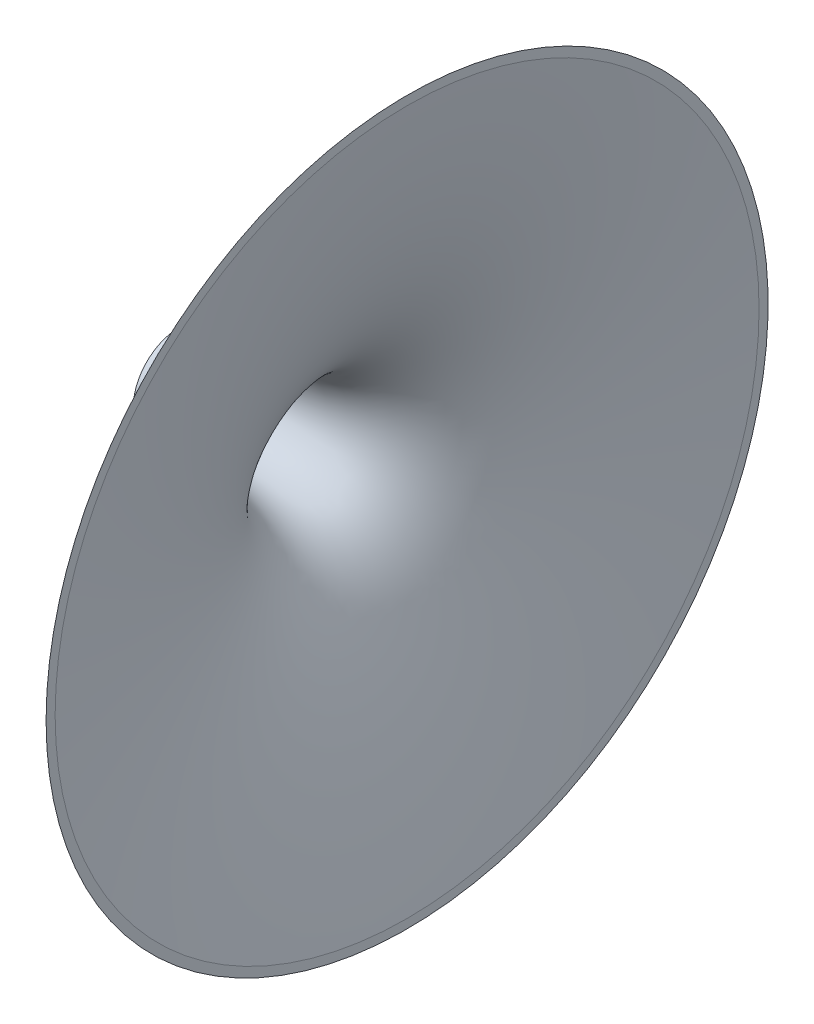
ISO-10303-21;
HEADER;
FILE_DESCRIPTION(('STEP AP214'),'2;1');
FILE_NAME('part.step','',(''),(''),'','','');
FILE_SCHEMA(('AUTOMOTIVE_DESIGN { 1 0 10303 214 1 1 1 1 }'));
ENDSEC;
DATA;
#1=APPLICATION_CONTEXT('core data for automotive mechanical design processes');
#2=APPLICATION_PROTOCOL_DEFINITION('international standard','automotive_design',2000,#1);
#3=PRODUCT_CONTEXT('',#1,'mechanical');
#4=PRODUCT('Part','Part','',(#3));
#5=PRODUCT_RELATED_PRODUCT_CATEGORY('part','',(#4));
#6=PRODUCT_DEFINITION_FORMATION('','',#4);
#7=PRODUCT_DEFINITION_CONTEXT('part definition',#1,'design');
#8=PRODUCT_DEFINITION('design','',#6,#7);
#9=PRODUCT_DEFINITION_SHAPE('','',#8);
#10=(LENGTH_UNIT() NAMED_UNIT(*) SI_UNIT(.MILLI.,.METRE.));
#11=(NAMED_UNIT(*) PLANE_ANGLE_UNIT() SI_UNIT($,.RADIAN.));
#12=(NAMED_UNIT(*) SI_UNIT($,.STERADIAN.) SOLID_ANGLE_UNIT());
#13=UNCERTAINTY_MEASURE_WITH_UNIT(LENGTH_MEASURE(1.E-05),#10,'distance_accuracy_value','');
#14=(GEOMETRIC_REPRESENTATION_CONTEXT(3) GLOBAL_UNCERTAINTY_ASSIGNED_CONTEXT((#13)) GLOBAL_UNIT_ASSIGNED_CONTEXT((#10,
#11,#12)) REPRESENTATION_CONTEXT('',''));
#15=CARTESIAN_POINT('',(0.,0.,0.));
#16=DIRECTION('',(0.,0.,1.));
#17=DIRECTION('',(1.,0.,0.));
#18=AXIS2_PLACEMENT_3D('',#15,#16,#17);
#19=CARTESIAN_POINT('',(62.8318530769264,99.7041526839094,0.));
#20=CARTESIAN_POINT('',(62.7669834738986,99.1988027934234,0.));
#21=CARTESIAN_POINT('',(62.6336701977316,98.1705809868923,0.));
#22=CARTESIAN_POINT('',(62.3544242130385,96.0424346727773,0.));
#23=CARTESIAN_POINT('',(62.0751013967572,93.9964608352909,0.));
#24=CARTESIAN_POINT('',(61.7313801557469,91.5195678656756,0.));
#25=CARTESIAN_POINT('',(61.410020240338,89.2917721485079,0.));
#26=CARTESIAN_POINT('',(61.0602038453941,86.9215437885587,0.));
#27=CARTESIAN_POINT('',(60.7101223802966,84.6334820961523,0.));
#28=CARTESIAN_POINT('',(60.2520981621779,81.725934740197,0.));
#29=CARTESIAN_POINT('',(59.681909059244,78.2673849163959,0.));
#30=CARTESIAN_POINT('',(58.9762772849989,74.2225813166756,0.));
#31=CARTESIAN_POINT('',(58.1107910302528,69.6207993004724,0.));
#32=CARTESIAN_POINT('',(57.1751523698545,65.0272397356999,0.));
#33=CARTESIAN_POINT('',(56.1586009502352,60.453904580494,0.));
#34=CARTESIAN_POINT('',(54.7684387417132,54.7628288542091,0.));
#35=CARTESIAN_POINT('',(53.1091163003201,48.8408966843822,0.));
#36=CARTESIAN_POINT('',(51.1729710091545,42.99939704834,0.));
#37=CARTESIAN_POINT('',(48.8444677468666,37.3182379190862,0.));
#38=CARTESIAN_POINT('',(46.8164012205755,33.2141247610398,0.));
#39=CARTESIAN_POINT('',(44.835264421067,29.8597976455631,0.));
#40=CARTESIAN_POINT('',(42.8548428486411,27.0548176259,0.));
#41=CARTESIAN_POINT('',(41.0428539358283,24.879922816341,0.));
#42=CARTESIAN_POINT('',(39.2170568829794,23.0223523189198,0.));
#43=CARTESIAN_POINT('',(37.4207145475656,21.4636501936447,0.));
#44=CARTESIAN_POINT('',(35.6358214509231,20.1378843785432,0.));
#45=CARTESIAN_POINT('',(33.7416925402109,18.9445961600642,0.));
#46=CARTESIAN_POINT('',(31.5993743316205,17.8108952161234,0.));
#47=CARTESIAN_POINT('',(29.2039422940924,16.7757108031768,0.));
#48=CARTESIAN_POINT('',(26.7821862036701,15.9449391265195,0.));
#49=CARTESIAN_POINT('',(24.3759366618418,15.2858495110727,0.));
#50=CARTESIAN_POINT('',(22.1229198972689,14.7809900065511,0.));
#51=CARTESIAN_POINT('',(20.034775641693,14.3916870651941,0.));
#52=CARTESIAN_POINT('',(17.4555340992771,13.9941368122836,0.));
#53=CARTESIAN_POINT('',(14.8721495276552,13.6857871928924,0.));
#54=CARTESIAN_POINT('',(12.3439656627703,13.4482991137871,0.));
#55=CARTESIAN_POINT('',(9.8065608570677,13.2591101041778,0.));
#56=CARTESIAN_POINT('',(7.71304149017419,13.1290273457748,0.));
#57=CARTESIAN_POINT('',(5.81949010738295,13.0323142166122,0.));
#58=CARTESIAN_POINT('',(4.17379671333692,12.960382125344,0.));
#59=CARTESIAN_POINT('',(2.75396102083383,12.9064290200789,0.));
#60=CARTESIAN_POINT('',(1.72293716722093,12.8702497615375,0.));
#61=CARTESIAN_POINT('',(0.734433958976591,12.8397158124545,0.));
#62=CARTESIAN_POINT('',(0.241417510162973,12.8251747616701,0.));
#63=CARTESIAN_POINT('',(1.66419893002975E-08,12.818309886657,0.));
#64=B_SPLINE_CURVE_WITH_KNOTS('',4,(#19,#20,#21,#22,#23,#24,#25,#26,#27,#28,#29,#30,#31,#32,#33,
#34,#35,#36,#37,#38,#39,#40,#41,#42,#43,#44,#45,#46,#47,#48,#49,#50,#51,#52,#53,#54,#55,#56,#57,
#58,#59,#60,#61,#62,#63),.UNSPECIFIED.,.F.,.F.,(5,1,1,1,1,1,1,1,1,1,1,1,1,1,1,1,1,1,1,1,1,1,1,1,
1,1,1,1,1,1,1,1,1,1,1,1,1,1,1,1,1,5),(0.0444810040283786,0.0610632796456602,0.0776455553349109,
0.0942278310241617,0.110810106713413,0.1273924442207,0.143974781727987,0.160557119235274,
0.177139456742561,0.210303468521247,0.243467480299934,0.276631409159663,0.309795338019393,
0.342959705599658,0.376124073179923,0.44245188977636,0.483876253842112,0.517040291529561,
0.549829175403092,0.571938566395502,0.594047848498678,0.614154571529794,0.629876067830825,
0.645596849685218,0.661317399353499,0.677038490645515,0.693192797636185,0.714153952455607,
0.735115088037345,0.749451703558317,0.763788319079289,0.779509218902208,0.795230118725127,
0.823340618425267,0.837395868275337,0.851451118125408,0.86717201284851,0.882892907571612,
0.890753354933163,0.898613802294714,0.906474249656265,0.914334697156908),.UNSPECIFIED.);
#65=CARTESIAN_POINT('',(0.,0.,0.));
#66=DIRECTION('',(-1.,0.,0.));
#67=AXIS1_PLACEMENT('',#65,#66);
#68=SURFACE_OF_REVOLUTION('',#64,#67);
#69=CARTESIAN_POINT('',(0.,0.,0.));
#70=DIRECTION('',(-1.,0.,0.));
#71=DIRECTION('',(0.,0.,1.));
#72=AXIS2_PLACEMENT_3D('',#69,#70,#71);
#73=CIRCLE('',#72,12.8183098861838);
#74=CARTESIAN_POINT('',(0.,0.,12.8183098861838));
#75=VERTEX_POINT('',#74);
#76=EDGE_CURVE('E48',#75,#75,#73,.T.);
#77=ORIENTED_EDGE('',*,*,#76,.F.);
#78=EDGE_LOOP('',(#77));
#79=FACE_BOUND('',#78,.T.);
#80=CARTESIAN_POINT('',(62.8318530717959,0.,0.));
#81=DIRECTION('',(-1.,0.,0.));
#82=DIRECTION('',(0.,0.,1.));
#83=AXIS2_PLACEMENT_3D('',#80,#81,#82);
#84=CIRCLE('',#83,99.7041526751117);
#85=CARTESIAN_POINT('',(62.8318530717959,0.,99.7041526751117));
#86=VERTEX_POINT('',#85);
#87=EDGE_CURVE('E10',#86,#86,#84,.T.);
#88=ORIENTED_EDGE('',*,*,#87,.T.);
#89=EDGE_LOOP('',(#88));
#90=FACE_BOUND('',#89,.T.);
#91=ADVANCED_FACE('F33',(#79,#90),#68,.T.);
#92=CARTESIAN_POINT('',(62.8318530719139,99.7041526751117,0.));
#93=DIRECTION('',(-1.,0.,0.));
#94=DIRECTION('',(0.,0.,1.));
#95=AXIS2_PLACEMENT_3D('',#92,#93,#94);
#96=PLANE('',#95);
#97=ORIENTED_EDGE('',*,*,#87,.F.);
#98=EDGE_LOOP('',(#97));
#99=FACE_BOUND('',#98,.T.);
#100=CARTESIAN_POINT('',(62.8318530720318,0.,0.));
#101=DIRECTION('',(-1.,0.,0.));
#102=DIRECTION('',(0.,0.,1.));
#103=AXIS2_PLACEMENT_3D('',#100,#101,#102);
#104=CIRCLE('',#103,97.2041526765341);
#105=CARTESIAN_POINT('',(62.8318530720318,0.,97.2041526765341));
#106=VERTEX_POINT('',#105);
#107=EDGE_CURVE('E40',#106,#106,#104,.T.);
#108=ORIENTED_EDGE('',*,*,#107,.T.);
#109=EDGE_LOOP('',(#108));
#110=FACE_BOUND('',#109,.T.);
#111=ADVANCED_FACE('F67',(#99,#110),#96,.F.);
#112=CARTESIAN_POINT('',(1.7518128061448E-09,10.3183098853196,0.));
#113=CARTESIAN_POINT('',(0.241417495273575,10.3251747603053,0.));
#114=CARTESIAN_POINT('',(0.734433944088842,10.3397158110338,0.));
#115=CARTESIAN_POINT('',(1.72293715233663,10.3702497600046,0.));
#116=CARTESIAN_POINT('',(2.75396100595366,10.4064290184291,0.));
#117=CARTESIAN_POINT('',(4.17379669846284,10.4603821235331,0.));
#118=CARTESIAN_POINT('',(5.81949009251707,10.5323142146147,0.));
#119=CARTESIAN_POINT('',(7.71304147531923,10.6290273435623,0.));
#120=CARTESIAN_POINT('',(9.80656084222754,10.759110101728,0.));
#121=CARTESIAN_POINT('',(12.3439656479516,10.9482991110493,0.));
#122=CARTESIAN_POINT('',(14.8721495128635,11.1857871898679,0.));
#123=CARTESIAN_POINT('',(17.4555340845202,11.4941368089661,0.));
#124=CARTESIAN_POINT('',(20.0347756269814,11.891687061584,0.));
#125=CARTESIAN_POINT('',(22.1229198826014,12.2809900027043,0.));
#126=CARTESIAN_POINT('',(24.3759366472314,12.78584950697,0.));
#127=CARTESIAN_POINT('',(26.7821861891347,13.4449391221442,0.));
#128=CARTESIAN_POINT('',(29.203942279651,14.2757107985264,0.));
#129=CARTESIAN_POINT('',(31.5993743172966,15.3108952112016,0.));
#130=CARTESIAN_POINT('',(33.7416925260159,16.4445961548992,0.));
#131=CARTESIAN_POINT('',(35.6358214368629,17.6378843731635,0.));
#132=CARTESIAN_POINT('',(37.4207145336564,18.9636501880625,0.));
#133=CARTESIAN_POINT('',(39.2170568692462,20.5223523131336,0.));
#134=CARTESIAN_POINT('',(41.0428539223067,22.379922810348,0.));
#135=CARTESIAN_POINT('',(42.8548428353658,24.554817619701,0.));
#136=CARTESIAN_POINT('',(44.8352644081097,27.35979763914,0.));
#137=CARTESIAN_POINT('',(46.8164012079994,30.7141247543918,0.));
#138=CARTESIAN_POINT('',(48.8444677347549,34.8182379122079,0.));
#139=CARTESIAN_POINT('',(51.1729709976887,40.4993970411981,0.));
#140=CARTESIAN_POINT('',(53.1091162895152,46.3408966770198,0.));
#141=CARTESIAN_POINT('',(54.7684387315818,52.2628288466598,0.));
#142=CARTESIAN_POINT('',(56.1586009407478,57.9539045727856,0.));
#143=CARTESIAN_POINT('',(57.1751523608872,62.5272397278771,0.));
#144=CARTESIAN_POINT('',(58.1107910218053,67.1207992925431,0.));
#145=CARTESIAN_POINT('',(58.9762772770747,71.7225813086486,0.));
#146=CARTESIAN_POINT('',(59.6819090517776,75.7673849082885,0.));
#147=CARTESIAN_POINT('',(60.2520981551045,79.225934732025,0.));
#148=CARTESIAN_POINT('',(60.7101223735525,82.1334820879281,0.));
#149=CARTESIAN_POINT('',(61.0602038389098,84.4215437802953,0.));
#150=CARTESIAN_POINT('',(61.4100202341226,86.7917721402041,0.));
#151=CARTESIAN_POINT('',(61.7313801497839,89.0195678573362,0.));
#152=CARTESIAN_POINT('',(62.0751013910758,91.4964608269119,0.));
#153=CARTESIAN_POINT('',(62.354424207626,93.5424346646427,0.));
#154=CARTESIAN_POINT('',(62.6336701926236,95.6705809792147,0.));
#155=CARTESIAN_POINT('',(62.7669834689147,96.6988027857973,0.));
#156=CARTESIAN_POINT('',(62.8318530720318,97.2041526765341,0.));
#157=B_SPLINE_CURVE_WITH_KNOTS('',4,(#112,#113,#114,#115,#116,#117,#118,#119,#120,#121,#122,
#123,#124,#125,#126,#127,#128,#129,#130,#131,#132,#133,#134,#135,#136,#137,#138,#139,#140,#141,
#142,#143,#144,#145,#146,#147,#148,#149,#150,#151,#152,#153,#154,#155,#156),.UNSPECIFIED.,.F.,
.F.,(5,1,1,1,1,1,1,1,1,1,1,1,1,1,1,1,1,1,1,1,1,1,1,1,1,1,1,1,1,1,1,1,1,1,1,1,1,1,1,1,1,5),
(0.044481004149583,0.0523414515290221,0.0602018988905731,0.0680623462521241,0.0759227936136751,
0.0916436883367771,0.107364583059879,0.121419832909949,0.13547508276002,0.16358558246016,
0.179306482283079,0.195027382105998,0.20936399762697,0.223700613147942,0.244661748729679,
0.265622903549102,0.281777210539771,0.297498301831788,0.313218851500068,0.328939633354461,
0.344661129655492,0.364767852686609,0.386877134789785,0.408986525782194,0.441775409655725,
0.474939447343174,0.516363811408927,0.582691628005364,0.615855995585629,0.649020363165894,
0.682184292025623,0.715348220885353,0.74851223266404,0.781676244442726,0.798258581950013,
0.8148409194573,0.831423256964587,0.848005594471874,0.864587870161125,0.881170145850376,
0.897752421539627,0.914334697228878),.UNSPECIFIED.);
#158=CARTESIAN_POINT('',(0.,0.,0.));
#159=DIRECTION('',(-1.,0.,0.));
#160=AXIS1_PLACEMENT('',#158,#159);
#161=SURFACE_OF_REVOLUTION('',#157,#160);
#162=ORIENTED_EDGE('',*,*,#107,.F.);
#163=EDGE_LOOP('',(#162));
#164=FACE_BOUND('',#163,.T.);
#165=CARTESIAN_POINT('',(0.,0.,0.));
#166=DIRECTION('',(-1.,0.,0.));
#167=DIRECTION('',(0.,0.,1.));
#168=AXIS2_PLACEMENT_3D('',#165,#166,#167);
#169=CIRCLE('',#168,10.3183098852698);
#170=CARTESIAN_POINT('',(0.,0.,10.3183098852698));
#171=VERTEX_POINT('',#170);
#172=EDGE_CURVE('E44',#171,#171,#169,.T.);
#173=ORIENTED_EDGE('',*,*,#172,.T.);
#174=EDGE_LOOP('',(#173));
#175=FACE_BOUND('',#174,.T.);
#176=ADVANCED_FACE('F63',(#164,#175),#161,.T.);
#177=CARTESIAN_POINT('',(0.,12.8183098861838,0.));
#178=DIRECTION('',(1.,0.,0.));
#179=DIRECTION('',(0.,0.,-1.));
#180=AXIS2_PLACEMENT_3D('',#177,#178,#179);
#181=PLANE('',#180);
#182=ORIENTED_EDGE('',*,*,#172,.F.);
#183=EDGE_LOOP('',(#182));
#184=FACE_BOUND('',#183,.T.);
#185=ORIENTED_EDGE('',*,*,#76,.T.);
#186=EDGE_LOOP('',(#185));
#187=FACE_BOUND('',#186,.T.);
#188=ADVANCED_FACE('F66',(#184,#187),#181,.F.);
#189=CLOSED_SHELL('',(#91,#111,#176,#188));
#190=MANIFOLD_SOLID_BREP('B2',#189);
#191=ADVANCED_BREP_SHAPE_REPRESENTATION('',(#18,#190),#14);
#192=SHAPE_DEFINITION_REPRESENTATION(#9,#191);
ENDSEC;
END-ISO-10303-21;
